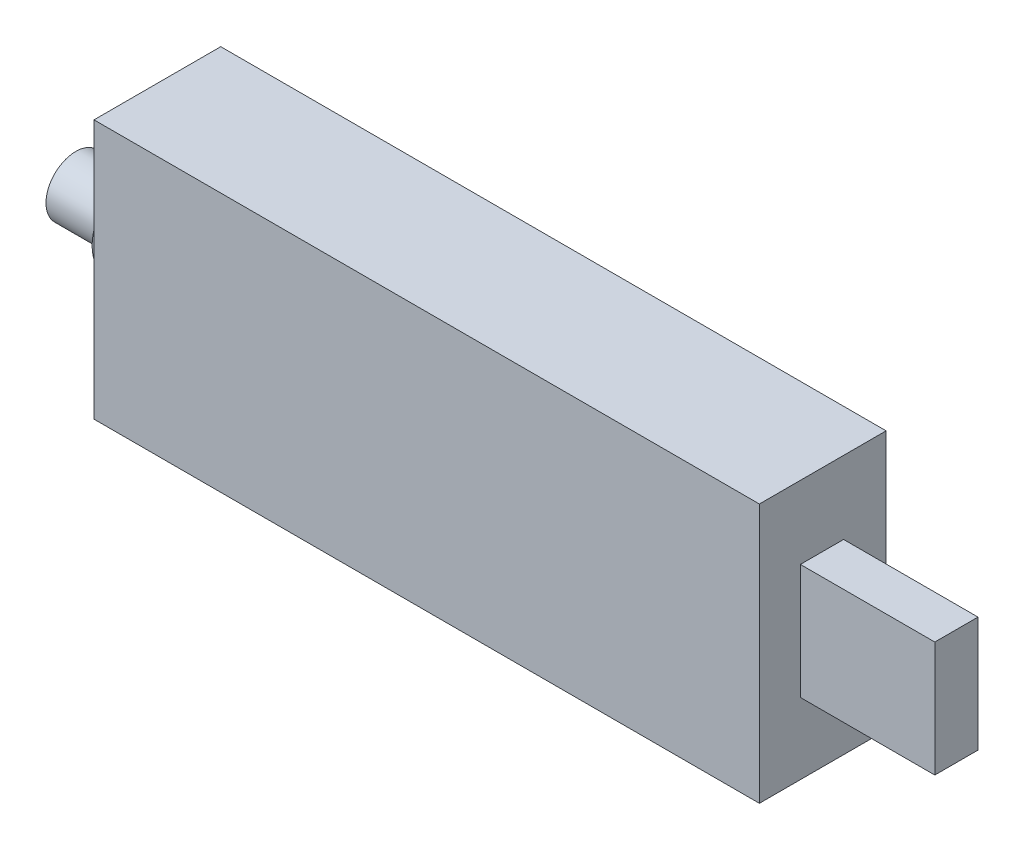
ISO-10303-21;
HEADER;
FILE_DESCRIPTION(('STEP AP214'),'2;1');
FILE_NAME('part.step','',(''),(''),'','','');
FILE_SCHEMA(('AUTOMOTIVE_DESIGN { 1 0 10303 214 1 1 1 1 }'));
ENDSEC;
DATA;
#1=APPLICATION_CONTEXT('core data for automotive mechanical design processes');
#2=APPLICATION_PROTOCOL_DEFINITION('international standard','automotive_design',2000,#1);
#3=PRODUCT_CONTEXT('',#1,'mechanical');
#4=PRODUCT('Part','Part','',(#3));
#5=PRODUCT_RELATED_PRODUCT_CATEGORY('part','',(#4));
#6=PRODUCT_DEFINITION_FORMATION('','',#4);
#7=PRODUCT_DEFINITION_CONTEXT('part definition',#1,'design');
#8=PRODUCT_DEFINITION('design','',#6,#7);
#9=PRODUCT_DEFINITION_SHAPE('','',#8);
#10=(LENGTH_UNIT() NAMED_UNIT(*) SI_UNIT(.MILLI.,.METRE.));
#11=(NAMED_UNIT(*) PLANE_ANGLE_UNIT() SI_UNIT($,.RADIAN.));
#12=(NAMED_UNIT(*) SI_UNIT($,.STERADIAN.) SOLID_ANGLE_UNIT());
#13=UNCERTAINTY_MEASURE_WITH_UNIT(LENGTH_MEASURE(1.E-05),#10,'distance_accuracy_value','');
#14=(GEOMETRIC_REPRESENTATION_CONTEXT(3) GLOBAL_UNCERTAINTY_ASSIGNED_CONTEXT((#13)) GLOBAL_UNIT_ASSIGNED_CONTEXT((#10,
#11,#12)) REPRESENTATION_CONTEXT('',''));
#15=CARTESIAN_POINT('',(0.,0.,0.));
#16=DIRECTION('',(0.,0.,1.));
#17=DIRECTION('',(1.,0.,0.));
#18=AXIS2_PLACEMENT_3D('',#15,#16,#17);
#19=CARTESIAN_POINT('',(0.,0.,13.2));
#20=DIRECTION('',(-1.,0.,0.));
#21=DIRECTION('',(0.,-1.,0.));
#22=AXIS2_PLACEMENT_3D('',#19,#20,#21);
#23=PLANE('',#22);
#24=DIRECTION('',(0.,1.,0.));
#25=VECTOR('',#24,1.);
#26=CARTESIAN_POINT('',(0.,0.,0.));
#27=LINE('',#26,#25);
#28=CARTESIAN_POINT('',(0.,0.,0.));
#29=VERTEX_POINT('',#28);
#30=CARTESIAN_POINT('',(0.,27.,0.));
#31=VERTEX_POINT('',#30);
#32=EDGE_CURVE('E130',#29,#31,#27,.T.);
#33=ORIENTED_EDGE('',*,*,#32,.T.);
#34=DIRECTION('',(0.,0.,-1.));
#35=VECTOR('',#34,1.);
#36=CARTESIAN_POINT('',(0.,27.,13.2));
#37=LINE('',#36,#35);
#38=CARTESIAN_POINT('',(0.,27.,13.2));
#39=VERTEX_POINT('',#38);
#40=EDGE_CURVE('E36',#39,#31,#37,.T.);
#41=ORIENTED_EDGE('',*,*,#40,.F.);
#42=DIRECTION('',(0.,1.,0.));
#43=VECTOR('',#42,1.);
#44=CARTESIAN_POINT('',(0.,0.,13.2));
#45=LINE('',#44,#43);
#46=CARTESIAN_POINT('',(0.,0.,13.2));
#47=VERTEX_POINT('',#46);
#48=EDGE_CURVE('E133',#47,#39,#45,.T.);
#49=ORIENTED_EDGE('',*,*,#48,.F.);
#50=DIRECTION('',(0.,0.,-1.));
#51=VECTOR('',#50,1.);
#52=CARTESIAN_POINT('',(0.,0.,13.2));
#53=LINE('',#52,#51);
#54=EDGE_CURVE('E143',#47,#29,#53,.T.);
#55=ORIENTED_EDGE('',*,*,#54,.T.);
#56=EDGE_LOOP('',(#33,#41,#49,#55));
#57=FACE_BOUND('',#56,.T.);
#58=DIRECTION('',(0.,-1.,0.));
#59=VECTOR('',#58,1.);
#60=CARTESIAN_POINT('',(0.,19.4149105967018,8.93005531029673));
#61=LINE('',#60,#59);
#62=CARTESIAN_POINT('',(0.,19.4149105967018,8.93005531029673));
#63=VERTEX_POINT('',#62);
#64=CARTESIAN_POINT('',(0.,7.4149105967018,8.93005531029673));
#65=VERTEX_POINT('',#64);
#66=EDGE_CURVE('E49',#63,#65,#61,.T.);
#67=ORIENTED_EDGE('',*,*,#66,.F.);
#68=DIRECTION('',(0.,0.,1.));
#69=VECTOR('',#68,1.);
#70=CARTESIAN_POINT('',(0.,19.4149105967018,4.43005531029673));
#71=LINE('',#70,#69);
#72=CARTESIAN_POINT('',(0.,19.4149105967018,4.43005531029673));
#73=VERTEX_POINT('',#72);
#74=EDGE_CURVE('E53',#73,#63,#71,.T.);
#75=ORIENTED_EDGE('',*,*,#74,.F.);
#76=DIRECTION('',(0.,1.,0.));
#77=VECTOR('',#76,1.);
#78=CARTESIAN_POINT('',(0.,19.4149105967018,4.43005531029673));
#79=LINE('',#78,#77);
#80=CARTESIAN_POINT('',(0.,7.4149105967018,4.43005531029673));
#81=VERTEX_POINT('',#80);
#82=EDGE_CURVE('E316',#81,#73,#79,.T.);
#83=ORIENTED_EDGE('',*,*,#82,.F.);
#84=DIRECTION('',(0.,0.,-1.));
#85=VECTOR('',#84,1.);
#86=CARTESIAN_POINT('',(0.,7.4149105967018,4.43005531029673));
#87=LINE('',#86,#85);
#88=EDGE_CURVE('E322',#65,#81,#87,.T.);
#89=ORIENTED_EDGE('',*,*,#88,.F.);
#90=EDGE_LOOP('',(#67,#75,#83,#89));
#91=FACE_BOUND('',#90,.T.);
#92=ADVANCED_FACE('F33',(#57,#91),#23,.F.);
#93=CARTESIAN_POINT('',(0.,27.,13.2));
#94=DIRECTION('',(0.,-1.,0.));
#95=DIRECTION('',(1.,0.,0.));
#96=AXIS2_PLACEMENT_3D('',#93,#94,#95);
#97=PLANE('',#96);
#98=DIRECTION('',(-1.,0.,0.));
#99=VECTOR('',#98,1.);
#100=CARTESIAN_POINT('',(0.,27.,0.));
#101=LINE('',#100,#99);
#102=CARTESIAN_POINT('',(-69.3,27.,0.));
#103=VERTEX_POINT('',#102);
#104=EDGE_CURVE('E146',#31,#103,#101,.T.);
#105=ORIENTED_EDGE('',*,*,#104,.T.);
#106=DIRECTION('',(0.,0.,-1.));
#107=VECTOR('',#106,1.);
#108=CARTESIAN_POINT('',(-69.3,27.,13.2));
#109=LINE('',#108,#107);
#110=CARTESIAN_POINT('',(-69.3,27.,13.2));
#111=VERTEX_POINT('',#110);
#112=EDGE_CURVE('E155',#111,#103,#109,.T.);
#113=ORIENTED_EDGE('',*,*,#112,.F.);
#114=DIRECTION('',(-1.,0.,0.));
#115=VECTOR('',#114,1.);
#116=CARTESIAN_POINT('',(0.,27.,13.2));
#117=LINE('',#116,#115);
#118=EDGE_CURVE('E136',#39,#111,#117,.T.);
#119=ORIENTED_EDGE('',*,*,#118,.F.);
#120=ORIENTED_EDGE('',*,*,#40,.T.);
#121=EDGE_LOOP('',(#105,#113,#119,#120));
#122=FACE_BOUND('',#121,.T.);
#123=ADVANCED_FACE('F164',(#122),#97,.F.);
#124=CARTESIAN_POINT('',(-69.3,0.,13.2));
#125=DIRECTION('',(1.,0.,0.));
#126=DIRECTION('',(0.,0.,-1.));
#127=AXIS2_PLACEMENT_3D('',#124,#125,#126);
#128=PLANE('',#127);
#129=CARTESIAN_POINT('',(-69.3,13.5,6.6));
#130=DIRECTION('',(-1.,0.,0.));
#131=DIRECTION('',(0.,0.,1.));
#132=AXIS2_PLACEMENT_3D('',#129,#130,#131);
#133=CIRCLE('',#132,4.55);
#134=CARTESIAN_POINT('',(-69.3,13.5,11.15));
#135=VERTEX_POINT('',#134);
#136=EDGE_CURVE('E41',#135,#135,#133,.T.);
#137=ORIENTED_EDGE('',*,*,#136,.F.);
#138=EDGE_LOOP('',(#137));
#139=FACE_BOUND('',#138,.T.);
#140=DIRECTION('',(0.,-1.,0.));
#141=VECTOR('',#140,1.);
#142=CARTESIAN_POINT('',(-69.3,0.,0.));
#143=LINE('',#142,#141);
#144=CARTESIAN_POINT('',(-69.3,0.,0.));
#145=VERTEX_POINT('',#144);
#146=EDGE_CURVE('E148',#103,#145,#143,.T.);
#147=ORIENTED_EDGE('',*,*,#146,.T.);
#148=DIRECTION('',(0.,0.,-1.));
#149=VECTOR('',#148,1.);
#150=CARTESIAN_POINT('',(-69.3,0.,13.2));
#151=LINE('',#150,#149);
#152=CARTESIAN_POINT('',(-69.3,0.,13.2));
#153=VERTEX_POINT('',#152);
#154=EDGE_CURVE('E153',#153,#145,#151,.T.);
#155=ORIENTED_EDGE('',*,*,#154,.F.);
#156=DIRECTION('',(0.,-1.,0.));
#157=VECTOR('',#156,1.);
#158=CARTESIAN_POINT('',(-69.3,0.,13.2));
#159=LINE('',#158,#157);
#160=EDGE_CURVE('E139',#111,#153,#159,.T.);
#161=ORIENTED_EDGE('',*,*,#160,.F.);
#162=ORIENTED_EDGE('',*,*,#112,.T.);
#163=EDGE_LOOP('',(#147,#155,#161,#162));
#164=FACE_BOUND('',#163,.T.);
#165=ADVANCED_FACE('F173',(#139,#164),#128,.F.);
#166=CARTESIAN_POINT('',(0.,0.,13.2));
#167=DIRECTION('',(0.,1.,0.));
#168=DIRECTION('',(0.,0.,1.));
#169=AXIS2_PLACEMENT_3D('',#166,#167,#168);
#170=PLANE('',#169);
#171=DIRECTION('',(1.,0.,0.));
#172=VECTOR('',#171,1.);
#173=CARTESIAN_POINT('',(0.,0.,0.));
#174=LINE('',#173,#172);
#175=EDGE_CURVE('E137',#145,#29,#174,.T.);
#176=ORIENTED_EDGE('',*,*,#175,.T.);
#177=ORIENTED_EDGE('',*,*,#54,.F.);
#178=DIRECTION('',(1.,0.,0.));
#179=VECTOR('',#178,1.);
#180=CARTESIAN_POINT('',(0.,0.,13.2));
#181=LINE('',#180,#179);
#182=EDGE_CURVE('E141',#153,#47,#181,.T.);
#183=ORIENTED_EDGE('',*,*,#182,.F.);
#184=ORIENTED_EDGE('',*,*,#154,.T.);
#185=EDGE_LOOP('',(#176,#177,#183,#184));
#186=FACE_BOUND('',#185,.T.);
#187=ADVANCED_FACE('F176',(#186),#170,.F.);
#188=CARTESIAN_POINT('',(0.,0.,13.2));
#189=DIRECTION('',(0.,0.,1.));
#190=DIRECTION('',(1.,0.,0.));
#191=AXIS2_PLACEMENT_3D('',#188,#189,#190);
#192=PLANE('',#191);
#193=ORIENTED_EDGE('',*,*,#48,.T.);
#194=ORIENTED_EDGE('',*,*,#118,.T.);
#195=ORIENTED_EDGE('',*,*,#160,.T.);
#196=ORIENTED_EDGE('',*,*,#182,.T.);
#197=EDGE_LOOP('',(#193,#194,#195,#196));
#198=FACE_BOUND('',#197,.T.);
#199=ADVANCED_FACE('F178',(#198),#192,.T.);
#200=CARTESIAN_POINT('',(0.,0.,0.));
#201=DIRECTION('',(0.,0.,1.));
#202=DIRECTION('',(1.,0.,0.));
#203=AXIS2_PLACEMENT_3D('',#200,#201,#202);
#204=PLANE('',#203);
#205=ORIENTED_EDGE('',*,*,#32,.F.);
#206=ORIENTED_EDGE('',*,*,#175,.F.);
#207=ORIENTED_EDGE('',*,*,#146,.F.);
#208=ORIENTED_EDGE('',*,*,#104,.F.);
#209=EDGE_LOOP('',(#205,#206,#207,#208));
#210=FACE_BOUND('',#209,.T.);
#211=ADVANCED_FACE('F171',(#210),#204,.F.);
#212=CARTESIAN_POINT('',(-71.55,13.5,6.6));
#213=DIRECTION('',(1.,0.,0.));
#214=DIRECTION('',(0.,0.,-1.));
#215=AXIS2_PLACEMENT_3D('',#212,#213,#214);
#216=CYLINDRICAL_SURFACE('',#215,4.55);
#217=CARTESIAN_POINT('',(-71.55,13.5,6.6));
#218=DIRECTION('',(-1.,0.,0.));
#219=DIRECTION('',(0.,0.,1.));
#220=AXIS2_PLACEMENT_3D('',#217,#218,#219);
#221=CIRCLE('',#220,4.55);
#222=CARTESIAN_POINT('',(-71.55,13.5,11.15));
#223=VERTEX_POINT('',#222);
#224=EDGE_CURVE('E122',#223,#223,#221,.T.);
#225=ORIENTED_EDGE('',*,*,#224,.F.);
#226=EDGE_LOOP('',(#225));
#227=FACE_BOUND('',#226,.T.);
#228=ORIENTED_EDGE('',*,*,#136,.T.);
#229=EDGE_LOOP('',(#228));
#230=FACE_BOUND('',#229,.T.);
#231=ADVANCED_FACE('F185',(#227,#230),#216,.T.);
#232=CARTESIAN_POINT('',(-71.55,13.5,6.6));
#233=DIRECTION('',(-1.,0.,0.));
#234=DIRECTION('',(0.,0.,1.));
#235=AXIS2_PLACEMENT_3D('',#232,#233,#234);
#236=PLANE('',#235);
#237=CARTESIAN_POINT('',(-71.55,13.5,6.6));
#238=DIRECTION('',(-1.,0.,0.));
#239=DIRECTION('',(0.,0.,1.));
#240=AXIS2_PLACEMENT_3D('',#237,#238,#239);
#241=CIRCLE('',#240,3.1);
#242=CARTESIAN_POINT('',(-71.55,13.5,9.7));
#243=VERTEX_POINT('',#242);
#244=EDGE_CURVE('E11',#243,#243,#241,.T.);
#245=ORIENTED_EDGE('',*,*,#244,.F.);
#246=EDGE_LOOP('',(#245));
#247=FACE_BOUND('',#246,.T.);
#248=ORIENTED_EDGE('',*,*,#224,.T.);
#249=EDGE_LOOP('',(#248));
#250=FACE_BOUND('',#249,.T.);
#251=ADVANCED_FACE('F203',(#247,#250),#236,.T.);
#252=CARTESIAN_POINT('',(-77.8,13.5,6.6));
#253=DIRECTION('',(1.,0.,0.));
#254=DIRECTION('',(0.,0.,-1.));
#255=AXIS2_PLACEMENT_3D('',#252,#253,#254);
#256=CYLINDRICAL_SURFACE('',#255,3.1);
#257=CARTESIAN_POINT('',(-77.8,13.5,6.6));
#258=DIRECTION('',(-1.,0.,0.));
#259=DIRECTION('',(0.,0.,1.));
#260=AXIS2_PLACEMENT_3D('',#257,#258,#259);
#261=CIRCLE('',#260,3.1);
#262=CARTESIAN_POINT('',(-77.8,13.5,9.7));
#263=VERTEX_POINT('',#262);
#264=EDGE_CURVE('E119',#263,#263,#261,.T.);
#265=ORIENTED_EDGE('',*,*,#264,.F.);
#266=EDGE_LOOP('',(#265));
#267=FACE_BOUND('',#266,.T.);
#268=ORIENTED_EDGE('',*,*,#244,.T.);
#269=EDGE_LOOP('',(#268));
#270=FACE_BOUND('',#269,.T.);
#271=ADVANCED_FACE('F208',(#267,#270),#256,.T.);
#272=CARTESIAN_POINT('',(-77.8,13.5,6.6));
#273=DIRECTION('',(-1.,0.,0.));
#274=DIRECTION('',(0.,0.,1.));
#275=AXIS2_PLACEMENT_3D('',#272,#273,#274);
#276=PLANE('',#275);
#277=ORIENTED_EDGE('',*,*,#264,.T.);
#278=EDGE_LOOP('',(#277));
#279=FACE_BOUND('',#278,.T.);
#280=ADVANCED_FACE('F215',(#279),#276,.T.);
#281=CARTESIAN_POINT('',(14.,19.4149105967018,8.93005531029673));
#282=DIRECTION('',(0.,0.,-1.));
#283=DIRECTION('',(-1.,0.,0.));
#284=AXIS2_PLACEMENT_3D('',#281,#282,#283);
#285=PLANE('',#284);
#286=ORIENTED_EDGE('',*,*,#66,.T.);
#287=DIRECTION('',(-1.,0.,0.));
#288=VECTOR('',#287,1.);
#289=CARTESIAN_POINT('',(14.,7.4149105967018,8.93005531029673));
#290=LINE('',#289,#288);
#291=CARTESIAN_POINT('',(14.,7.4149105967018,8.93005531029673));
#292=VERTEX_POINT('',#291);
#293=EDGE_CURVE('E102',#292,#65,#290,.T.);
#294=ORIENTED_EDGE('',*,*,#293,.F.);
#295=DIRECTION('',(0.,-1.,0.));
#296=VECTOR('',#295,1.);
#297=CARTESIAN_POINT('',(14.,19.4149105967018,8.93005531029673));
#298=LINE('',#297,#296);
#299=CARTESIAN_POINT('',(14.,19.4149105967018,8.93005531029673));
#300=VERTEX_POINT('',#299);
#301=EDGE_CURVE('E108',#300,#292,#298,.T.);
#302=ORIENTED_EDGE('',*,*,#301,.F.);
#303=DIRECTION('',(-1.,0.,0.));
#304=VECTOR('',#303,1.);
#305=CARTESIAN_POINT('',(14.,19.4149105967018,8.93005531029673));
#306=LINE('',#305,#304);
#307=EDGE_CURVE('E314',#300,#63,#306,.T.);
#308=ORIENTED_EDGE('',*,*,#307,.T.);
#309=EDGE_LOOP('',(#286,#294,#302,#308));
#310=FACE_BOUND('',#309,.T.);
#311=ADVANCED_FACE('F118',(#310),#285,.F.);
#312=CARTESIAN_POINT('',(14.,7.4149105967018,4.43005531029673));
#313=DIRECTION('',(0.,1.,0.));
#314=DIRECTION('',(-1.,0.,0.));
#315=AXIS2_PLACEMENT_3D('',#312,#313,#314);
#316=PLANE('',#315);
#317=ORIENTED_EDGE('',*,*,#88,.T.);
#318=DIRECTION('',(-1.,0.,0.));
#319=VECTOR('',#318,1.);
#320=CARTESIAN_POINT('',(14.,7.4149105967018,4.43005531029673));
#321=LINE('',#320,#319);
#322=CARTESIAN_POINT('',(14.,7.4149105967018,4.43005531029673));
#323=VERTEX_POINT('',#322);
#324=EDGE_CURVE('E104',#323,#81,#321,.T.);
#325=ORIENTED_EDGE('',*,*,#324,.F.);
#326=DIRECTION('',(0.,0.,-1.));
#327=VECTOR('',#326,1.);
#328=CARTESIAN_POINT('',(14.,7.4149105967018,4.43005531029673));
#329=LINE('',#328,#327);
#330=EDGE_CURVE('E97',#292,#323,#329,.T.);
#331=ORIENTED_EDGE('',*,*,#330,.F.);
#332=ORIENTED_EDGE('',*,*,#293,.T.);
#333=EDGE_LOOP('',(#317,#325,#331,#332));
#334=FACE_BOUND('',#333,.T.);
#335=ADVANCED_FACE('F100',(#334),#316,.F.);
#336=CARTESIAN_POINT('',(14.,19.4149105967018,4.43005531029673));
#337=DIRECTION('',(0.,0.,1.));
#338=DIRECTION('',(0.,-1.,0.));
#339=AXIS2_PLACEMENT_3D('',#336,#337,#338);
#340=PLANE('',#339);
#341=ORIENTED_EDGE('',*,*,#82,.T.);
#342=DIRECTION('',(-1.,0.,0.));
#343=VECTOR('',#342,1.);
#344=CARTESIAN_POINT('',(14.,19.4149105967018,4.43005531029673));
#345=LINE('',#344,#343);
#346=CARTESIAN_POINT('',(14.,19.4149105967018,4.43005531029673));
#347=VERTEX_POINT('',#346);
#348=EDGE_CURVE('E124',#347,#73,#345,.T.);
#349=ORIENTED_EDGE('',*,*,#348,.F.);
#350=DIRECTION('',(0.,1.,0.));
#351=VECTOR('',#350,1.);
#352=CARTESIAN_POINT('',(14.,19.4149105967018,4.43005531029673));
#353=LINE('',#352,#351);
#354=EDGE_CURVE('E107',#323,#347,#353,.T.);
#355=ORIENTED_EDGE('',*,*,#354,.F.);
#356=ORIENTED_EDGE('',*,*,#324,.T.);
#357=EDGE_LOOP('',(#341,#349,#355,#356));
#358=FACE_BOUND('',#357,.T.);
#359=ADVANCED_FACE('F224',(#358),#340,.F.);
#360=CARTESIAN_POINT('',(14.,19.4149105967018,4.43005531029673));
#361=DIRECTION('',(0.,-1.,0.));
#362=DIRECTION('',(1.,0.,0.));
#363=AXIS2_PLACEMENT_3D('',#360,#361,#362);
#364=PLANE('',#363);
#365=ORIENTED_EDGE('',*,*,#74,.T.);
#366=ORIENTED_EDGE('',*,*,#307,.F.);
#367=DIRECTION('',(0.,0.,1.));
#368=VECTOR('',#367,1.);
#369=CARTESIAN_POINT('',(14.,19.4149105967018,4.43005531029673));
#370=LINE('',#369,#368);
#371=EDGE_CURVE('E113',#347,#300,#370,.T.);
#372=ORIENTED_EDGE('',*,*,#371,.F.);
#373=ORIENTED_EDGE('',*,*,#348,.T.);
#374=EDGE_LOOP('',(#365,#366,#372,#373));
#375=FACE_BOUND('',#374,.T.);
#376=ADVANCED_FACE('F227',(#375),#364,.F.);
#377=CARTESIAN_POINT('',(14.,0.,0.));
#378=DIRECTION('',(-1.,0.,0.));
#379=DIRECTION('',(0.,-1.,0.));
#380=AXIS2_PLACEMENT_3D('',#377,#378,#379);
#381=PLANE('',#380);
#382=ORIENTED_EDGE('',*,*,#301,.T.);
#383=ORIENTED_EDGE('',*,*,#330,.T.);
#384=ORIENTED_EDGE('',*,*,#354,.T.);
#385=ORIENTED_EDGE('',*,*,#371,.T.);
#386=EDGE_LOOP('',(#382,#383,#384,#385));
#387=FACE_BOUND('',#386,.T.);
#388=ADVANCED_FACE('F111',(#387),#381,.F.);
#389=CLOSED_SHELL('',(#92,#123,#165,#187,#199,#211,#231,#251,#271,#280,#311,#335,#359,#376,#388));
#390=MANIFOLD_SOLID_BREP('B2',#389);
#391=ADVANCED_BREP_SHAPE_REPRESENTATION('',(#18,#390),#14);
#392=SHAPE_DEFINITION_REPRESENTATION(#9,#391);
ENDSEC;
END-ISO-10303-21;
